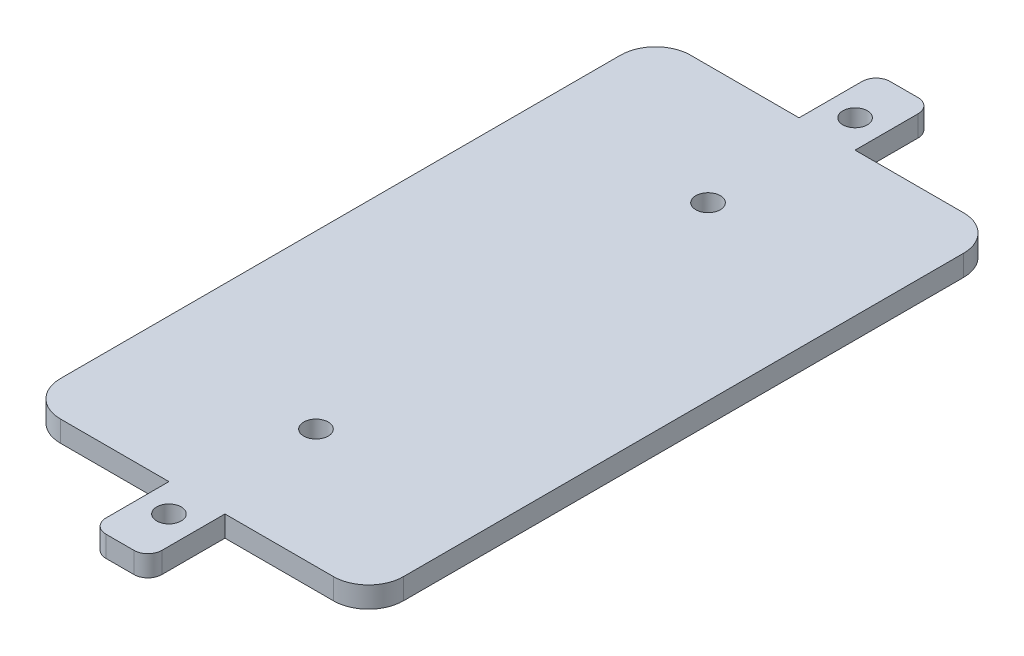
ISO-10303-21;
HEADER;
FILE_DESCRIPTION(('STEP AP214'),'2;1');
FILE_NAME('part.step','',(''),(''),'','','');
FILE_SCHEMA(('AUTOMOTIVE_DESIGN { 1 0 10303 214 1 1 1 1 }'));
ENDSEC;
DATA;
#1=APPLICATION_CONTEXT('core data for automotive mechanical design processes');
#2=APPLICATION_PROTOCOL_DEFINITION('international standard','automotive_design',2000,#1);
#3=PRODUCT_CONTEXT('',#1,'mechanical');
#4=PRODUCT('Part','Part','',(#3));
#5=PRODUCT_RELATED_PRODUCT_CATEGORY('part','',(#4));
#6=PRODUCT_DEFINITION_FORMATION('','',#4);
#7=PRODUCT_DEFINITION_CONTEXT('part definition',#1,'design');
#8=PRODUCT_DEFINITION('design','',#6,#7);
#9=PRODUCT_DEFINITION_SHAPE('','',#8);
#10=(LENGTH_UNIT() NAMED_UNIT(*) SI_UNIT(.MILLI.,.METRE.));
#11=(NAMED_UNIT(*) PLANE_ANGLE_UNIT() SI_UNIT($,.RADIAN.));
#12=(NAMED_UNIT(*) SI_UNIT($,.STERADIAN.) SOLID_ANGLE_UNIT());
#13=UNCERTAINTY_MEASURE_WITH_UNIT(LENGTH_MEASURE(1.E-05),#10,'distance_accuracy_value','');
#14=(GEOMETRIC_REPRESENTATION_CONTEXT(3) GLOBAL_UNCERTAINTY_ASSIGNED_CONTEXT((#13)) GLOBAL_UNIT_ASSIGNED_CONTEXT((#10,
#11,#12)) REPRESENTATION_CONTEXT('',''));
#15=CARTESIAN_POINT('',(0.,0.,0.));
#16=DIRECTION('',(0.,0.,1.));
#17=DIRECTION('',(1.,0.,0.));
#18=AXIS2_PLACEMENT_3D('',#15,#16,#17);
#19=CARTESIAN_POINT('',(0.,3.,45.));
#20=DIRECTION('',(0.,0.,-1.));
#21=DIRECTION('',(-1.,0.,0.));
#22=AXIS2_PLACEMENT_3D('',#19,#20,#21);
#23=PLANE('',#22);
#24=DIRECTION('',(1.,0.,0.));
#25=VECTOR('',#24,1.);
#26=CARTESIAN_POINT('',(0.,3.,45.));
#27=LINE('',#26,#25);
#28=CARTESIAN_POINT('',(-19.5,3.,45.));
#29=VERTEX_POINT('',#28);
#30=CARTESIAN_POINT('',(-4.,3.,45.));
#31=VERTEX_POINT('',#30);
#32=EDGE_CURVE('E175',#29,#31,#27,.T.);
#33=ORIENTED_EDGE('',*,*,#32,.F.);
#34=DIRECTION('',(0.,-1.,0.));
#35=VECTOR('',#34,1.);
#36=CARTESIAN_POINT('',(-19.5,0.,45.));
#37=LINE('',#36,#35);
#38=CARTESIAN_POINT('',(-19.5,0.,45.));
#39=VERTEX_POINT('',#38);
#40=EDGE_CURVE('E245',#29,#39,#37,.T.);
#41=ORIENTED_EDGE('',*,*,#40,.T.);
#42=DIRECTION('',(1.,0.,0.));
#43=VECTOR('',#42,1.);
#44=CARTESIAN_POINT('',(0.,0.,45.));
#45=LINE('',#44,#43);
#46=CARTESIAN_POINT('',(-4.,0.,45.));
#47=VERTEX_POINT('',#46);
#48=EDGE_CURVE('E201',#39,#47,#45,.T.);
#49=ORIENTED_EDGE('',*,*,#48,.T.);
#50=DIRECTION('',(0.,-1.,0.));
#51=VECTOR('',#50,1.);
#52=CARTESIAN_POINT('',(-4.,3.,45.));
#53=LINE('',#52,#51);
#54=EDGE_CURVE('E195',#31,#47,#53,.T.);
#55=ORIENTED_EDGE('',*,*,#54,.F.);
#56=EDGE_LOOP('',(#33,#41,#49,#55));
#57=FACE_BOUND('',#56,.T.);
#58=ADVANCED_FACE('F37',(#57),#23,.F.);
#59=CARTESIAN_POINT('',(-4.00000000000001,3.,0.));
#60=DIRECTION('',(1.,0.,0.));
#61=DIRECTION('',(0.,0.,-1.));
#62=AXIS2_PLACEMENT_3D('',#59,#60,#61);
#63=PLANE('',#62);
#64=DIRECTION('',(0.,0.,1.));
#65=VECTOR('',#64,1.);
#66=CARTESIAN_POINT('',(-4.00000000000001,0.,0.));
#67=LINE('',#66,#65);
#68=CARTESIAN_POINT('',(-4.,0.,54.));
#69=VERTEX_POINT('',#68);
#70=EDGE_CURVE('E347',#47,#69,#67,.T.);
#71=ORIENTED_EDGE('',*,*,#70,.T.);
#72=DIRECTION('',(0.,-1.,0.));
#73=VECTOR('',#72,1.);
#74=CARTESIAN_POINT('',(-4.,3.,54.));
#75=LINE('',#74,#73);
#76=CARTESIAN_POINT('',(-4.,3.,54.));
#77=VERTEX_POINT('',#76);
#78=EDGE_CURVE('E197',#69,#77,#75,.F.);
#79=ORIENTED_EDGE('',*,*,#78,.T.);
#80=DIRECTION('',(0.,0.,1.));
#81=VECTOR('',#80,1.);
#82=CARTESIAN_POINT('',(-4.00000000000001,3.,0.));
#83=LINE('',#82,#81);
#84=EDGE_CURVE('E180',#31,#77,#83,.T.);
#85=ORIENTED_EDGE('',*,*,#84,.F.);
#86=ORIENTED_EDGE('',*,*,#54,.T.);
#87=EDGE_LOOP('',(#71,#79,#85,#86));
#88=FACE_BOUND('',#87,.T.);
#89=ADVANCED_FACE('F194',(#88),#63,.F.);
#90=CARTESIAN_POINT('',(0.,3.,56.));
#91=DIRECTION('',(0.,0.,-1.));
#92=DIRECTION('',(-1.,0.,0.));
#93=AXIS2_PLACEMENT_3D('',#90,#91,#92);
#94=PLANE('',#93);
#95=DIRECTION('',(1.,0.,0.));
#96=VECTOR('',#95,1.);
#97=CARTESIAN_POINT('',(0.,0.,56.));
#98=LINE('',#97,#96);
#99=CARTESIAN_POINT('',(-2.,0.,56.));
#100=VERTEX_POINT('',#99);
#101=CARTESIAN_POINT('',(2.,0.,56.));
#102=VERTEX_POINT('',#101);
#103=EDGE_CURVE('E350',#100,#102,#98,.T.);
#104=ORIENTED_EDGE('',*,*,#103,.T.);
#105=DIRECTION('',(0.,-1.,0.));
#106=VECTOR('',#105,1.);
#107=CARTESIAN_POINT('',(2.,3.,56.));
#108=LINE('',#107,#106);
#109=CARTESIAN_POINT('',(2.,3.,56.));
#110=VERTEX_POINT('',#109);
#111=EDGE_CURVE('E242',#102,#110,#108,.F.);
#112=ORIENTED_EDGE('',*,*,#111,.T.);
#113=DIRECTION('',(1.,0.,0.));
#114=VECTOR('',#113,1.);
#115=CARTESIAN_POINT('',(0.,3.,56.));
#116=LINE('',#115,#114);
#117=CARTESIAN_POINT('',(-2.,3.,56.));
#118=VERTEX_POINT('',#117);
#119=EDGE_CURVE('E198',#118,#110,#116,.T.);
#120=ORIENTED_EDGE('',*,*,#119,.F.);
#121=DIRECTION('',(0.,-1.,0.));
#122=VECTOR('',#121,1.);
#123=CARTESIAN_POINT('',(-2.,3.,56.));
#124=LINE('',#123,#122);
#125=EDGE_CURVE('E239',#118,#100,#124,.T.);
#126=ORIENTED_EDGE('',*,*,#125,.T.);
#127=EDGE_LOOP('',(#104,#112,#120,#126));
#128=FACE_BOUND('',#127,.T.);
#129=ADVANCED_FACE('F384',(#128),#94,.F.);
#130=CARTESIAN_POINT('',(4.,3.,0.));
#131=DIRECTION('',(-1.,0.,0.));
#132=DIRECTION('',(0.,0.,1.));
#133=AXIS2_PLACEMENT_3D('',#130,#131,#132);
#134=PLANE('',#133);
#135=DIRECTION('',(0.,0.,-1.));
#136=VECTOR('',#135,1.);
#137=CARTESIAN_POINT('',(4.,3.,0.));
#138=LINE('',#137,#136);
#139=CARTESIAN_POINT('',(4.,3.,54.));
#140=VERTEX_POINT('',#139);
#141=CARTESIAN_POINT('',(4.,3.,45.));
#142=VERTEX_POINT('',#141);
#143=EDGE_CURVE('E429',#140,#142,#138,.T.);
#144=ORIENTED_EDGE('',*,*,#143,.F.);
#145=DIRECTION('',(0.,-1.,0.));
#146=VECTOR('',#145,1.);
#147=CARTESIAN_POINT('',(4.,3.,54.));
#148=LINE('',#147,#146);
#149=CARTESIAN_POINT('',(4.,0.,54.));
#150=VERTEX_POINT('',#149);
#151=EDGE_CURVE('E236',#140,#150,#148,.T.);
#152=ORIENTED_EDGE('',*,*,#151,.T.);
#153=DIRECTION('',(0.,0.,-1.));
#154=VECTOR('',#153,1.);
#155=CARTESIAN_POINT('',(4.,0.,0.));
#156=LINE('',#155,#154);
#157=CARTESIAN_POINT('',(4.,0.,45.));
#158=VERTEX_POINT('',#157);
#159=EDGE_CURVE('E353',#150,#158,#156,.T.);
#160=ORIENTED_EDGE('',*,*,#159,.T.);
#161=DIRECTION('',(0.,-1.,0.));
#162=VECTOR('',#161,1.);
#163=CARTESIAN_POINT('',(4.,3.,45.));
#164=LINE('',#163,#162);
#165=EDGE_CURVE('E204',#142,#158,#164,.T.);
#166=ORIENTED_EDGE('',*,*,#165,.F.);
#167=EDGE_LOOP('',(#144,#152,#160,#166));
#168=FACE_BOUND('',#167,.T.);
#169=ADVANCED_FACE('F389',(#168),#134,.F.);
#170=CARTESIAN_POINT('',(19.5,0.,45.));
#171=VERTEX_POINT('',#170);
#172=EDGE_CURVE('E293',#158,#171,#45,.T.);
#173=ORIENTED_EDGE('',*,*,#172,.T.);
#174=DIRECTION('',(0.,-1.,0.));
#175=VECTOR('',#174,1.);
#176=CARTESIAN_POINT('',(19.5,3.,45.));
#177=LINE('',#176,#175);
#178=CARTESIAN_POINT('',(19.5,3.,45.));
#179=VERTEX_POINT('',#178);
#180=EDGE_CURVE('E270',#171,#179,#177,.F.);
#181=ORIENTED_EDGE('',*,*,#180,.T.);
#182=EDGE_CURVE('E190',#142,#179,#27,.T.);
#183=ORIENTED_EDGE('',*,*,#182,.F.);
#184=ORIENTED_EDGE('',*,*,#165,.T.);
#185=EDGE_LOOP('',(#173,#181,#183,#184));
#186=FACE_BOUND('',#185,.T.);
#187=ADVANCED_FACE('F361',(#186),#23,.F.);
#188=CARTESIAN_POINT('',(24.5,3.,0.));
#189=DIRECTION('',(-1.,0.,0.));
#190=DIRECTION('',(0.,0.,1.));
#191=AXIS2_PLACEMENT_3D('',#188,#189,#190);
#192=PLANE('',#191);
#193=DIRECTION('',(0.,0.,-1.));
#194=VECTOR('',#193,1.);
#195=CARTESIAN_POINT('',(24.5,3.,0.));
#196=LINE('',#195,#194);
#197=CARTESIAN_POINT('',(24.5,3.,40.));
#198=VERTEX_POINT('',#197);
#199=CARTESIAN_POINT('',(24.5,3.,-40.));
#200=VERTEX_POINT('',#199);
#201=EDGE_CURVE('E320',#198,#200,#196,.T.);
#202=ORIENTED_EDGE('',*,*,#201,.F.);
#203=DIRECTION('',(0.,-1.,0.));
#204=VECTOR('',#203,1.);
#205=CARTESIAN_POINT('',(24.5,3.,40.));
#206=LINE('',#205,#204);
#207=CARTESIAN_POINT('',(24.5,0.,40.));
#208=VERTEX_POINT('',#207);
#209=EDGE_CURVE('E267',#198,#208,#206,.T.);
#210=ORIENTED_EDGE('',*,*,#209,.T.);
#211=DIRECTION('',(0.,0.,-1.));
#212=VECTOR('',#211,1.);
#213=CARTESIAN_POINT('',(24.5,0.,0.));
#214=LINE('',#213,#212);
#215=CARTESIAN_POINT('',(24.5,0.,-40.));
#216=VERTEX_POINT('',#215);
#217=EDGE_CURVE('E288',#208,#216,#214,.T.);
#218=ORIENTED_EDGE('',*,*,#217,.T.);
#219=DIRECTION('',(0.,-1.,0.));
#220=VECTOR('',#219,1.);
#221=CARTESIAN_POINT('',(24.5,3.,-40.));
#222=LINE('',#221,#220);
#223=EDGE_CURVE('E60',#216,#200,#222,.F.);
#224=ORIENTED_EDGE('',*,*,#223,.T.);
#225=EDGE_LOOP('',(#202,#210,#218,#224));
#226=FACE_BOUND('',#225,.T.);
#227=ADVANCED_FACE('F368',(#226),#192,.F.);
#228=CARTESIAN_POINT('',(0.,3.,-45.));
#229=DIRECTION('',(0.,0.,-1.));
#230=DIRECTION('',(-1.,0.,0.));
#231=AXIS2_PLACEMENT_3D('',#228,#229,#230);
#232=PLANE('',#231);
#233=DIRECTION('',(1.,0.,0.));
#234=VECTOR('',#233,1.);
#235=CARTESIAN_POINT('',(0.,3.,-45.));
#236=LINE('',#235,#234);
#237=CARTESIAN_POINT('',(3.99999999999994,3.,-45.));
#238=VERTEX_POINT('',#237);
#239=CARTESIAN_POINT('',(19.5,3.,-45.));
#240=VERTEX_POINT('',#239);
#241=EDGE_CURVE('E279',#238,#240,#236,.T.);
#242=ORIENTED_EDGE('',*,*,#241,.T.);
#243=DIRECTION('',(0.,-1.,0.));
#244=VECTOR('',#243,1.);
#245=CARTESIAN_POINT('',(19.5,0.,-45.));
#246=LINE('',#245,#244);
#247=CARTESIAN_POINT('',(19.5,0.,-45.));
#248=VERTEX_POINT('',#247);
#249=EDGE_CURVE('E45',#240,#248,#246,.T.);
#250=ORIENTED_EDGE('',*,*,#249,.T.);
#251=DIRECTION('',(1.,0.,0.));
#252=VECTOR('',#251,1.);
#253=CARTESIAN_POINT('',(0.,0.,-45.));
#254=LINE('',#253,#252);
#255=CARTESIAN_POINT('',(3.99999999999994,0.,-45.));
#256=VERTEX_POINT('',#255);
#257=EDGE_CURVE('E278',#256,#248,#254,.T.);
#258=ORIENTED_EDGE('',*,*,#257,.F.);
#259=DIRECTION('',(0.,-1.,0.));
#260=VECTOR('',#259,1.);
#261=CARTESIAN_POINT('',(3.99999999999994,3.,-45.));
#262=LINE('',#261,#260);
#263=EDGE_CURVE('E209',#238,#256,#262,.T.);
#264=ORIENTED_EDGE('',*,*,#263,.F.);
#265=EDGE_LOOP('',(#242,#250,#258,#264));
#266=FACE_BOUND('',#265,.T.);
#267=ADVANCED_FACE('F276',(#266),#232,.T.);
#268=CARTESIAN_POINT('',(4.00000000000001,3.,0.));
#269=DIRECTION('',(1.,0.,0.));
#270=DIRECTION('',(0.,0.,-1.));
#271=AXIS2_PLACEMENT_3D('',#268,#269,#270);
#272=PLANE('',#271);
#273=DIRECTION('',(0.,0.,1.));
#274=VECTOR('',#273,1.);
#275=CARTESIAN_POINT('',(4.00000000000001,0.,0.));
#276=LINE('',#275,#274);
#277=CARTESIAN_POINT('',(3.99999999999994,0.,-54.));
#278=VERTEX_POINT('',#277);
#279=EDGE_CURVE('E286',#278,#256,#276,.T.);
#280=ORIENTED_EDGE('',*,*,#279,.F.);
#281=DIRECTION('',(0.,-1.,0.));
#282=VECTOR('',#281,1.);
#283=CARTESIAN_POINT('',(3.99999999999994,3.,-54.));
#284=LINE('',#283,#282);
#285=CARTESIAN_POINT('',(3.99999999999994,3.,-54.));
#286=VERTEX_POINT('',#285);
#287=EDGE_CURVE('E223',#278,#286,#284,.F.);
#288=ORIENTED_EDGE('',*,*,#287,.T.);
#289=DIRECTION('',(0.,0.,1.));
#290=VECTOR('',#289,1.);
#291=CARTESIAN_POINT('',(4.00000000000001,3.,0.));
#292=LINE('',#291,#290);
#293=EDGE_CURVE('E318',#286,#238,#292,.T.);
#294=ORIENTED_EDGE('',*,*,#293,.T.);
#295=ORIENTED_EDGE('',*,*,#263,.T.);
#296=EDGE_LOOP('',(#280,#288,#294,#295));
#297=FACE_BOUND('',#296,.T.);
#298=ADVANCED_FACE('F315',(#297),#272,.T.);
#299=CARTESIAN_POINT('',(0.,3.,-56.));
#300=DIRECTION('',(0.,0.,-1.));
#301=DIRECTION('',(-1.,0.,0.));
#302=AXIS2_PLACEMENT_3D('',#299,#300,#301);
#303=PLANE('',#302);
#304=DIRECTION('',(1.,0.,0.));
#305=VECTOR('',#304,1.);
#306=CARTESIAN_POINT('',(0.,3.,-56.));
#307=LINE('',#306,#305);
#308=CARTESIAN_POINT('',(-2.00000000000006,3.,-56.));
#309=VERTEX_POINT('',#308);
#310=CARTESIAN_POINT('',(1.99999999999994,3.,-56.));
#311=VERTEX_POINT('',#310);
#312=EDGE_CURVE('E323',#309,#311,#307,.T.);
#313=ORIENTED_EDGE('',*,*,#312,.T.);
#314=DIRECTION('',(0.,-1.,0.));
#315=VECTOR('',#314,1.);
#316=CARTESIAN_POINT('',(1.99999999999994,3.,-56.));
#317=LINE('',#316,#315);
#318=CARTESIAN_POINT('',(1.99999999999994,0.,-56.));
#319=VERTEX_POINT('',#318);
#320=EDGE_CURVE('E206',#311,#319,#317,.T.);
#321=ORIENTED_EDGE('',*,*,#320,.T.);
#322=DIRECTION('',(1.,0.,0.));
#323=VECTOR('',#322,1.);
#324=CARTESIAN_POINT('',(0.,0.,-56.));
#325=LINE('',#324,#323);
#326=CARTESIAN_POINT('',(-2.00000000000006,0.,-56.));
#327=VERTEX_POINT('',#326);
#328=EDGE_CURVE('E291',#327,#319,#325,.T.);
#329=ORIENTED_EDGE('',*,*,#328,.F.);
#330=DIRECTION('',(0.,-1.,0.));
#331=VECTOR('',#330,1.);
#332=CARTESIAN_POINT('',(-2.00000000000006,3.,-56.));
#333=LINE('',#332,#331);
#334=EDGE_CURVE('E203',#327,#309,#333,.F.);
#335=ORIENTED_EDGE('',*,*,#334,.T.);
#336=EDGE_LOOP('',(#313,#321,#329,#335));
#337=FACE_BOUND('',#336,.T.);
#338=ADVANCED_FACE('F482',(#337),#303,.T.);
#339=CARTESIAN_POINT('',(-4.,3.,0.));
#340=DIRECTION('',(-1.,0.,0.));
#341=DIRECTION('',(0.,0.,1.));
#342=AXIS2_PLACEMENT_3D('',#339,#340,#341);
#343=PLANE('',#342);
#344=DIRECTION('',(0.,0.,-1.));
#345=VECTOR('',#344,1.);
#346=CARTESIAN_POINT('',(-4.,3.,0.));
#347=LINE('',#346,#345);
#348=CARTESIAN_POINT('',(-4.00000000000006,3.,-45.));
#349=VERTEX_POINT('',#348);
#350=CARTESIAN_POINT('',(-4.00000000000006,3.,-54.));
#351=VERTEX_POINT('',#350);
#352=EDGE_CURVE('E327',#349,#351,#347,.T.);
#353=ORIENTED_EDGE('',*,*,#352,.T.);
#354=DIRECTION('',(0.,-1.,0.));
#355=VECTOR('',#354,1.);
#356=CARTESIAN_POINT('',(-4.00000000000006,3.,-54.));
#357=LINE('',#356,#355);
#358=CARTESIAN_POINT('',(-4.00000000000006,0.,-54.));
#359=VERTEX_POINT('',#358);
#360=EDGE_CURVE('E233',#351,#359,#357,.T.);
#361=ORIENTED_EDGE('',*,*,#360,.T.);
#362=DIRECTION('',(0.,0.,-1.));
#363=VECTOR('',#362,1.);
#364=CARTESIAN_POINT('',(-4.,0.,0.));
#365=LINE('',#364,#363);
#366=CARTESIAN_POINT('',(-4.00000000000006,0.,-45.));
#367=VERTEX_POINT('',#366);
#368=EDGE_CURVE('E296',#367,#359,#365,.T.);
#369=ORIENTED_EDGE('',*,*,#368,.F.);
#370=DIRECTION('',(0.,-1.,0.));
#371=VECTOR('',#370,1.);
#372=CARTESIAN_POINT('',(-4.00000000000006,3.,-45.));
#373=LINE('',#372,#371);
#374=EDGE_CURVE('E312',#349,#367,#373,.T.);
#375=ORIENTED_EDGE('',*,*,#374,.F.);
#376=EDGE_LOOP('',(#353,#361,#369,#375));
#377=FACE_BOUND('',#376,.T.);
#378=ADVANCED_FACE('F479',(#377),#343,.T.);
#379=CARTESIAN_POINT('',(-19.5,0.,-45.));
#380=VERTEX_POINT('',#379);
#381=EDGE_CURVE('E290',#380,#367,#254,.T.);
#382=ORIENTED_EDGE('',*,*,#381,.F.);
#383=DIRECTION('',(0.,-1.,0.));
#384=VECTOR('',#383,1.);
#385=CARTESIAN_POINT('',(-19.5,3.,-45.));
#386=LINE('',#385,#384);
#387=CARTESIAN_POINT('',(-19.5,3.,-45.));
#388=VERTEX_POINT('',#387);
#389=EDGE_CURVE('E11',#380,#388,#386,.F.);
#390=ORIENTED_EDGE('',*,*,#389,.T.);
#391=EDGE_CURVE('E322',#388,#349,#236,.T.);
#392=ORIENTED_EDGE('',*,*,#391,.T.);
#393=ORIENTED_EDGE('',*,*,#374,.T.);
#394=EDGE_LOOP('',(#382,#390,#392,#393));
#395=FACE_BOUND('',#394,.T.);
#396=ADVANCED_FACE('F472',(#395),#232,.T.);
#397=CARTESIAN_POINT('',(0.,3.,-49.));
#398=DIRECTION('',(0.,-1.,0.));
#399=DIRECTION('',(0.,0.,-1.));
#400=AXIS2_PLACEMENT_3D('',#397,#398,#399);
#401=CYLINDRICAL_SURFACE('',#400,1.75);
#402=CARTESIAN_POINT('',(0.,3.,-49.));
#403=DIRECTION('',(0.,1.,0.));
#404=DIRECTION('',(0.,0.,1.));
#405=AXIS2_PLACEMENT_3D('',#402,#403,#404);
#406=CIRCLE('',#405,1.75);
#407=CARTESIAN_POINT('',(0.,3.,-47.25));
#408=VERTEX_POINT('',#407);
#409=EDGE_CURVE('E332',#408,#408,#406,.F.);
#410=ORIENTED_EDGE('',*,*,#409,.F.);
#411=EDGE_LOOP('',(#410));
#412=FACE_BOUND('',#411,.T.);
#413=CARTESIAN_POINT('',(0.,0.,-49.));
#414=DIRECTION('',(0.,1.,0.));
#415=DIRECTION('',(0.,0.,1.));
#416=AXIS2_PLACEMENT_3D('',#413,#414,#415);
#417=CIRCLE('',#416,1.75);
#418=CARTESIAN_POINT('',(0.,0.,-47.25));
#419=VERTEX_POINT('',#418);
#420=EDGE_CURVE('E301',#419,#419,#417,.F.);
#421=ORIENTED_EDGE('',*,*,#420,.T.);
#422=EDGE_LOOP('',(#421));
#423=FACE_BOUND('',#422,.T.);
#424=ADVANCED_FACE('F469',(#412,#423),#401,.F.);
#425=CARTESIAN_POINT('',(-24.5,3.,0.));
#426=DIRECTION('',(-1.,0.,0.));
#427=DIRECTION('',(0.,0.,1.));
#428=AXIS2_PLACEMENT_3D('',#425,#426,#427);
#429=PLANE('',#428);
#430=DIRECTION('',(0.,0.,-1.));
#431=VECTOR('',#430,1.);
#432=CARTESIAN_POINT('',(-24.5,0.,0.));
#433=LINE('',#432,#431);
#434=CARTESIAN_POINT('',(-24.5,0.,40.));
#435=VERTEX_POINT('',#434);
#436=CARTESIAN_POINT('',(-24.5,0.,-40.));
#437=VERTEX_POINT('',#436);
#438=EDGE_CURVE('E295',#435,#437,#433,.T.);
#439=ORIENTED_EDGE('',*,*,#438,.F.);
#440=DIRECTION('',(0.,-1.,0.));
#441=VECTOR('',#440,1.);
#442=CARTESIAN_POINT('',(-24.5,3.,40.));
#443=LINE('',#442,#441);
#444=CARTESIAN_POINT('',(-24.5,3.,40.));
#445=VERTEX_POINT('',#444);
#446=EDGE_CURVE('E258',#435,#445,#443,.F.);
#447=ORIENTED_EDGE('',*,*,#446,.T.);
#448=DIRECTION('',(0.,0.,-1.));
#449=VECTOR('',#448,1.);
#450=CARTESIAN_POINT('',(-24.5,3.,0.));
#451=LINE('',#450,#449);
#452=CARTESIAN_POINT('',(-24.5,3.,-40.));
#453=VERTEX_POINT('',#452);
#454=EDGE_CURVE('E326',#445,#453,#451,.T.);
#455=ORIENTED_EDGE('',*,*,#454,.T.);
#456=DIRECTION('',(0.,-1.,0.));
#457=VECTOR('',#456,1.);
#458=CARTESIAN_POINT('',(-24.5,3.,-40.));
#459=LINE('',#458,#457);
#460=EDGE_CURVE('E255',#453,#437,#459,.T.);
#461=ORIENTED_EDGE('',*,*,#460,.T.);
#462=EDGE_LOOP('',(#439,#447,#455,#461));
#463=FACE_BOUND('',#462,.T.);
#464=ADVANCED_FACE('F467',(#463),#429,.T.);
#465=CARTESIAN_POINT('',(0.,3.,49.));
#466=DIRECTION('',(0.,-1.,0.));
#467=DIRECTION('',(0.,0.,-1.));
#468=AXIS2_PLACEMENT_3D('',#465,#466,#467);
#469=CYLINDRICAL_SURFACE('',#468,1.75);
#470=CARTESIAN_POINT('',(0.,3.,49.));
#471=DIRECTION('',(0.,1.,0.));
#472=DIRECTION('',(0.,0.,1.));
#473=AXIS2_PLACEMENT_3D('',#470,#471,#472);
#474=CIRCLE('',#473,1.75);
#475=CARTESIAN_POINT('',(0.,3.,50.75));
#476=VERTEX_POINT('',#475);
#477=EDGE_CURVE('E313',#476,#476,#474,.T.);
#478=ORIENTED_EDGE('',*,*,#477,.T.);
#479=EDGE_LOOP('',(#478));
#480=FACE_BOUND('',#479,.T.);
#481=CARTESIAN_POINT('',(0.,0.,49.));
#482=DIRECTION('',(0.,1.,0.));
#483=DIRECTION('',(0.,0.,1.));
#484=AXIS2_PLACEMENT_3D('',#481,#482,#483);
#485=CIRCLE('',#484,1.75);
#486=CARTESIAN_POINT('',(0.,0.,50.75));
#487=VERTEX_POINT('',#486);
#488=EDGE_CURVE('E188',#487,#487,#485,.T.);
#489=ORIENTED_EDGE('',*,*,#488,.F.);
#490=EDGE_LOOP('',(#489));
#491=FACE_BOUND('',#490,.T.);
#492=ADVANCED_FACE('F462',(#480,#491),#469,.F.);
#493=CARTESIAN_POINT('',(0.,3.,0.));
#494=DIRECTION('',(0.,1.,0.));
#495=DIRECTION('',(0.,0.,1.));
#496=AXIS2_PLACEMENT_3D('',#493,#494,#495);
#497=PLANE('',#496);
#498=CARTESIAN_POINT('',(0.,3.,-28.));
#499=DIRECTION('',(0.,1.,0.));
#500=DIRECTION('',(0.,0.,1.));
#501=AXIS2_PLACEMENT_3D('',#498,#499,#500);
#502=CIRCLE('',#501,1.75);
#503=CARTESIAN_POINT('',(0.,3.,-26.25));
#504=VERTEX_POINT('',#503);
#505=EDGE_CURVE('E348',#504,#504,#502,.T.);
#506=ORIENTED_EDGE('',*,*,#505,.F.);
#507=EDGE_LOOP('',(#506));
#508=FACE_BOUND('',#507,.T.);
#509=CARTESIAN_POINT('',(0.,3.,28.));
#510=DIRECTION('',(0.,1.,0.));
#511=DIRECTION('',(0.,0.,1.));
#512=AXIS2_PLACEMENT_3D('',#509,#510,#511);
#513=CIRCLE('',#512,1.75);
#514=CARTESIAN_POINT('',(0.,3.,29.75));
#515=VERTEX_POINT('',#514);
#516=EDGE_CURVE('E435',#515,#515,#513,.T.);
#517=ORIENTED_EDGE('',*,*,#516,.F.);
#518=EDGE_LOOP('',(#517));
#519=FACE_BOUND('',#518,.T.);
#520=ORIENTED_EDGE('',*,*,#454,.F.);
#521=CARTESIAN_POINT('',(-19.5,3.,40.));
#522=DIRECTION('',(0.,1.,0.));
#523=DIRECTION('',(0.,0.,1.));
#524=AXIS2_PLACEMENT_3D('',#521,#522,#523);
#525=CIRCLE('',#524,5.);
#526=EDGE_CURVE('E183',#445,#29,#525,.T.);
#527=ORIENTED_EDGE('',*,*,#526,.T.);
#528=ORIENTED_EDGE('',*,*,#32,.T.);
#529=ORIENTED_EDGE('',*,*,#84,.T.);
#530=CARTESIAN_POINT('',(-2.,3.,54.));
#531=DIRECTION('',(0.,1.,0.));
#532=DIRECTION('',(0.,0.,1.));
#533=AXIS2_PLACEMENT_3D('',#530,#531,#532);
#534=CIRCLE('',#533,2.);
#535=EDGE_CURVE('E225',#77,#118,#534,.T.);
#536=ORIENTED_EDGE('',*,*,#535,.T.);
#537=ORIENTED_EDGE('',*,*,#119,.T.);
#538=CARTESIAN_POINT('',(2.,3.,54.));
#539=DIRECTION('',(0.,1.,0.));
#540=DIRECTION('',(0.,0.,1.));
#541=AXIS2_PLACEMENT_3D('',#538,#539,#540);
#542=CIRCLE('',#541,2.);
#543=EDGE_CURVE('E227',#110,#140,#542,.T.);
#544=ORIENTED_EDGE('',*,*,#543,.T.);
#545=ORIENTED_EDGE('',*,*,#143,.T.);
#546=ORIENTED_EDGE('',*,*,#182,.T.);
#547=CARTESIAN_POINT('',(19.5,3.,40.));
#548=DIRECTION('',(0.,1.,0.));
#549=DIRECTION('',(0.,0.,1.));
#550=AXIS2_PLACEMENT_3D('',#547,#548,#549);
#551=CIRCLE('',#550,5.);
#552=EDGE_CURVE('E263',#179,#198,#551,.T.);
#553=ORIENTED_EDGE('',*,*,#552,.T.);
#554=ORIENTED_EDGE('',*,*,#201,.T.);
#555=CARTESIAN_POINT('',(19.5,3.,-40.));
#556=DIRECTION('',(0.,1.,0.));
#557=DIRECTION('',(0.,0.,1.));
#558=AXIS2_PLACEMENT_3D('',#555,#556,#557);
#559=CIRCLE('',#558,5.);
#560=EDGE_CURVE('E52',#200,#240,#559,.T.);
#561=ORIENTED_EDGE('',*,*,#560,.T.);
#562=ORIENTED_EDGE('',*,*,#241,.F.);
#563=ORIENTED_EDGE('',*,*,#293,.F.);
#564=CARTESIAN_POINT('',(1.99999999999994,3.,-54.));
#565=DIRECTION('',(0.,1.,0.));
#566=DIRECTION('',(0.,0.,1.));
#567=AXIS2_PLACEMENT_3D('',#564,#565,#566);
#568=CIRCLE('',#567,2.);
#569=EDGE_CURVE('E231',#286,#311,#568,.T.);
#570=ORIENTED_EDGE('',*,*,#569,.T.);
#571=ORIENTED_EDGE('',*,*,#312,.F.);
#572=CARTESIAN_POINT('',(-2.00000000000006,3.,-54.));
#573=DIRECTION('',(0.,1.,0.));
#574=DIRECTION('',(0.,0.,1.));
#575=AXIS2_PLACEMENT_3D('',#572,#573,#574);
#576=CIRCLE('',#575,2.);
#577=EDGE_CURVE('E229',#309,#351,#576,.T.);
#578=ORIENTED_EDGE('',*,*,#577,.T.);
#579=ORIENTED_EDGE('',*,*,#352,.F.);
#580=ORIENTED_EDGE('',*,*,#391,.F.);
#581=CARTESIAN_POINT('',(-19.5,3.,-40.));
#582=DIRECTION('',(0.,1.,0.));
#583=DIRECTION('',(0.,0.,1.));
#584=AXIS2_PLACEMENT_3D('',#581,#582,#583);
#585=CIRCLE('',#584,5.);
#586=EDGE_CURVE('E260',#388,#453,#585,.T.);
#587=ORIENTED_EDGE('',*,*,#586,.T.);
#588=EDGE_LOOP('',(#520,#527,#528,#529,#536,#537,#544,#545,#546,#553,#554,#561,#562,#563,#570,
#571,#578,#579,#580,#587));
#589=FACE_BOUND('',#588,.T.);
#590=ORIENTED_EDGE('',*,*,#409,.T.);
#591=EDGE_LOOP('',(#590));
#592=FACE_BOUND('',#591,.T.);
#593=ORIENTED_EDGE('',*,*,#477,.F.);
#594=EDGE_LOOP('',(#593));
#595=FACE_BOUND('',#594,.T.);
#596=ADVANCED_FACE('F178',(#508,#519,#589,#592,#595),#497,.T.);
#597=CARTESIAN_POINT('',(0.,0.,0.));
#598=DIRECTION('',(0.,1.,0.));
#599=DIRECTION('',(0.,0.,1.));
#600=AXIS2_PLACEMENT_3D('',#597,#598,#599);
#601=PLANE('',#600);
#602=CARTESIAN_POINT('',(0.,0.,-28.));
#603=DIRECTION('',(0.,-1.,0.));
#604=DIRECTION('',(0.,0.,-1.));
#605=AXIS2_PLACEMENT_3D('',#602,#603,#604);
#606=CIRCLE('',#605,1.75);
#607=CARTESIAN_POINT('',(0.,0.,-29.75));
#608=VERTEX_POINT('',#607);
#609=EDGE_CURVE('E438',#608,#608,#606,.T.);
#610=ORIENTED_EDGE('',*,*,#609,.F.);
#611=EDGE_LOOP('',(#610));
#612=FACE_BOUND('',#611,.T.);
#613=CARTESIAN_POINT('',(0.,0.,28.));
#614=DIRECTION('',(0.,-1.,0.));
#615=DIRECTION('',(0.,0.,-1.));
#616=AXIS2_PLACEMENT_3D('',#613,#614,#615);
#617=CIRCLE('',#616,1.75);
#618=CARTESIAN_POINT('',(0.,0.,26.25));
#619=VERTEX_POINT('',#618);
#620=EDGE_CURVE('E439',#619,#619,#617,.T.);
#621=ORIENTED_EDGE('',*,*,#620,.F.);
#622=EDGE_LOOP('',(#621));
#623=FACE_BOUND('',#622,.T.);
#624=ORIENTED_EDGE('',*,*,#48,.F.);
#625=CARTESIAN_POINT('',(-19.5,0.,40.));
#626=DIRECTION('',(0.,1.,0.));
#627=DIRECTION('',(0.,0.,1.));
#628=AXIS2_PLACEMENT_3D('',#625,#626,#627);
#629=CIRCLE('',#628,5.);
#630=EDGE_CURVE('E253',#39,#435,#629,.F.);
#631=ORIENTED_EDGE('',*,*,#630,.T.);
#632=ORIENTED_EDGE('',*,*,#438,.T.);
#633=CARTESIAN_POINT('',(-19.5,0.,-40.));
#634=DIRECTION('',(0.,1.,0.));
#635=DIRECTION('',(0.,0.,1.));
#636=AXIS2_PLACEMENT_3D('',#633,#634,#635);
#637=CIRCLE('',#636,5.);
#638=EDGE_CURVE('E247',#437,#380,#637,.F.);
#639=ORIENTED_EDGE('',*,*,#638,.T.);
#640=ORIENTED_EDGE('',*,*,#381,.T.);
#641=ORIENTED_EDGE('',*,*,#368,.T.);
#642=CARTESIAN_POINT('',(-2.00000000000006,0.,-54.));
#643=DIRECTION('',(0.,1.,0.));
#644=DIRECTION('',(0.,0.,1.));
#645=AXIS2_PLACEMENT_3D('',#642,#643,#644);
#646=CIRCLE('',#645,2.);
#647=EDGE_CURVE('E219',#359,#327,#646,.F.);
#648=ORIENTED_EDGE('',*,*,#647,.T.);
#649=ORIENTED_EDGE('',*,*,#328,.T.);
#650=CARTESIAN_POINT('',(1.99999999999994,0.,-54.));
#651=DIRECTION('',(0.,1.,0.));
#652=DIRECTION('',(0.,0.,1.));
#653=AXIS2_PLACEMENT_3D('',#650,#651,#652);
#654=CIRCLE('',#653,2.);
#655=EDGE_CURVE('E221',#319,#278,#654,.F.);
#656=ORIENTED_EDGE('',*,*,#655,.T.);
#657=ORIENTED_EDGE('',*,*,#279,.T.);
#658=ORIENTED_EDGE('',*,*,#257,.T.);
#659=CARTESIAN_POINT('',(19.5,0.,-40.));
#660=DIRECTION('',(0.,1.,0.));
#661=DIRECTION('',(0.,0.,1.));
#662=AXIS2_PLACEMENT_3D('',#659,#660,#661);
#663=CIRCLE('',#662,5.);
#664=EDGE_CURVE('E249',#248,#216,#663,.F.);
#665=ORIENTED_EDGE('',*,*,#664,.T.);
#666=ORIENTED_EDGE('',*,*,#217,.F.);
#667=CARTESIAN_POINT('',(19.5,0.,40.));
#668=DIRECTION('',(0.,1.,0.));
#669=DIRECTION('',(0.,0.,1.));
#670=AXIS2_PLACEMENT_3D('',#667,#668,#669);
#671=CIRCLE('',#670,5.);
#672=EDGE_CURVE('E251',#208,#171,#671,.F.);
#673=ORIENTED_EDGE('',*,*,#672,.T.);
#674=ORIENTED_EDGE('',*,*,#172,.F.);
#675=ORIENTED_EDGE('',*,*,#159,.F.);
#676=CARTESIAN_POINT('',(2.,0.,54.));
#677=DIRECTION('',(0.,1.,0.));
#678=DIRECTION('',(0.,0.,1.));
#679=AXIS2_PLACEMENT_3D('',#676,#677,#678);
#680=CIRCLE('',#679,2.);
#681=EDGE_CURVE('E217',#150,#102,#680,.F.);
#682=ORIENTED_EDGE('',*,*,#681,.T.);
#683=ORIENTED_EDGE('',*,*,#103,.F.);
#684=CARTESIAN_POINT('',(-2.,0.,54.));
#685=DIRECTION('',(0.,1.,0.));
#686=DIRECTION('',(0.,0.,1.));
#687=AXIS2_PLACEMENT_3D('',#684,#685,#686);
#688=CIRCLE('',#687,2.);
#689=EDGE_CURVE('E215',#100,#69,#688,.F.);
#690=ORIENTED_EDGE('',*,*,#689,.T.);
#691=ORIENTED_EDGE('',*,*,#70,.F.);
#692=EDGE_LOOP('',(#624,#631,#632,#639,#640,#641,#648,#649,#656,#657,#658,#665,#666,#673,#674,
#675,#682,#683,#690,#691));
#693=FACE_BOUND('',#692,.T.);
#694=ORIENTED_EDGE('',*,*,#420,.F.);
#695=EDGE_LOOP('',(#694));
#696=FACE_BOUND('',#695,.T.);
#697=ORIENTED_EDGE('',*,*,#488,.T.);
#698=EDGE_LOOP('',(#697));
#699=FACE_BOUND('',#698,.T.);
#700=ADVANCED_FACE('F282',(#612,#623,#693,#696,#699),#601,.F.);
#701=CARTESIAN_POINT('',(1.99999999999994,3.,-54.));
#702=DIRECTION('',(0.,-1.,0.));
#703=DIRECTION('',(0.,0.,-1.));
#704=AXIS2_PLACEMENT_3D('',#701,#702,#703);
#705=CYLINDRICAL_SURFACE('',#704,2.);
#706=ORIENTED_EDGE('',*,*,#569,.F.);
#707=ORIENTED_EDGE('',*,*,#287,.F.);
#708=ORIENTED_EDGE('',*,*,#655,.F.);
#709=ORIENTED_EDGE('',*,*,#320,.F.);
#710=EDGE_LOOP('',(#706,#707,#708,#709));
#711=FACE_BOUND('',#710,.T.);
#712=ADVANCED_FACE('F401',(#711),#705,.T.);
#713=CARTESIAN_POINT('',(-2.00000000000006,3.,-54.));
#714=DIRECTION('',(0.,-1.,0.));
#715=DIRECTION('',(0.,0.,-1.));
#716=AXIS2_PLACEMENT_3D('',#713,#714,#715);
#717=CYLINDRICAL_SURFACE('',#716,2.);
#718=ORIENTED_EDGE('',*,*,#577,.F.);
#719=ORIENTED_EDGE('',*,*,#334,.F.);
#720=ORIENTED_EDGE('',*,*,#647,.F.);
#721=ORIENTED_EDGE('',*,*,#360,.F.);
#722=EDGE_LOOP('',(#718,#719,#720,#721));
#723=FACE_BOUND('',#722,.T.);
#724=ADVANCED_FACE('F404',(#723),#717,.T.);
#725=CARTESIAN_POINT('',(2.,3.,54.));
#726=DIRECTION('',(0.,-1.,0.));
#727=DIRECTION('',(0.,0.,-1.));
#728=AXIS2_PLACEMENT_3D('',#725,#726,#727);
#729=CYLINDRICAL_SURFACE('',#728,2.);
#730=ORIENTED_EDGE('',*,*,#543,.F.);
#731=ORIENTED_EDGE('',*,*,#111,.F.);
#732=ORIENTED_EDGE('',*,*,#681,.F.);
#733=ORIENTED_EDGE('',*,*,#151,.F.);
#734=EDGE_LOOP('',(#730,#731,#732,#733));
#735=FACE_BOUND('',#734,.T.);
#736=ADVANCED_FACE('F408',(#735),#729,.T.);
#737=CARTESIAN_POINT('',(-2.,3.,54.));
#738=DIRECTION('',(0.,-1.,0.));
#739=DIRECTION('',(0.,0.,-1.));
#740=AXIS2_PLACEMENT_3D('',#737,#738,#739);
#741=CYLINDRICAL_SURFACE('',#740,2.);
#742=ORIENTED_EDGE('',*,*,#535,.F.);
#743=ORIENTED_EDGE('',*,*,#78,.F.);
#744=ORIENTED_EDGE('',*,*,#689,.F.);
#745=ORIENTED_EDGE('',*,*,#125,.F.);
#746=EDGE_LOOP('',(#742,#743,#744,#745));
#747=FACE_BOUND('',#746,.T.);
#748=ADVANCED_FACE('F412',(#747),#741,.T.);
#749=CARTESIAN_POINT('',(-19.5,3.,40.));
#750=DIRECTION('',(0.,1.,0.));
#751=DIRECTION('',(0.,0.,1.));
#752=AXIS2_PLACEMENT_3D('',#749,#750,#751);
#753=CYLINDRICAL_SURFACE('',#752,5.);
#754=ORIENTED_EDGE('',*,*,#526,.F.);
#755=ORIENTED_EDGE('',*,*,#446,.F.);
#756=ORIENTED_EDGE('',*,*,#630,.F.);
#757=ORIENTED_EDGE('',*,*,#40,.F.);
#758=EDGE_LOOP('',(#754,#755,#756,#757));
#759=FACE_BOUND('',#758,.T.);
#760=ADVANCED_FACE('F377',(#759),#753,.T.);
#761=CARTESIAN_POINT('',(19.5,3.,40.));
#762=DIRECTION('',(0.,-1.,0.));
#763=DIRECTION('',(0.,0.,-1.));
#764=AXIS2_PLACEMENT_3D('',#761,#762,#763);
#765=CYLINDRICAL_SURFACE('',#764,5.);
#766=ORIENTED_EDGE('',*,*,#552,.F.);
#767=ORIENTED_EDGE('',*,*,#180,.F.);
#768=ORIENTED_EDGE('',*,*,#672,.F.);
#769=ORIENTED_EDGE('',*,*,#209,.F.);
#770=EDGE_LOOP('',(#766,#767,#768,#769));
#771=FACE_BOUND('',#770,.T.);
#772=ADVANCED_FACE('F366',(#771),#765,.T.);
#773=CARTESIAN_POINT('',(19.5,3.,-40.));
#774=DIRECTION('',(0.,1.,0.));
#775=DIRECTION('',(0.,0.,1.));
#776=AXIS2_PLACEMENT_3D('',#773,#774,#775);
#777=CYLINDRICAL_SURFACE('',#776,5.);
#778=ORIENTED_EDGE('',*,*,#560,.F.);
#779=ORIENTED_EDGE('',*,*,#223,.F.);
#780=ORIENTED_EDGE('',*,*,#664,.F.);
#781=ORIENTED_EDGE('',*,*,#249,.F.);
#782=EDGE_LOOP('',(#778,#779,#780,#781));
#783=FACE_BOUND('',#782,.T.);
#784=ADVANCED_FACE('F369',(#783),#777,.T.);
#785=CARTESIAN_POINT('',(-19.5,3.,-40.));
#786=DIRECTION('',(0.,-1.,0.));
#787=DIRECTION('',(0.,0.,-1.));
#788=AXIS2_PLACEMENT_3D('',#785,#786,#787);
#789=CYLINDRICAL_SURFACE('',#788,5.);
#790=ORIENTED_EDGE('',*,*,#586,.F.);
#791=ORIENTED_EDGE('',*,*,#389,.F.);
#792=ORIENTED_EDGE('',*,*,#638,.F.);
#793=ORIENTED_EDGE('',*,*,#460,.F.);
#794=EDGE_LOOP('',(#790,#791,#792,#793));
#795=FACE_BOUND('',#794,.T.);
#796=ADVANCED_FACE('F39',(#795),#789,.T.);
#797=CARTESIAN_POINT('',(0.,10.,28.));
#798=DIRECTION('',(0.,-1.,0.));
#799=DIRECTION('',(0.,0.,-1.));
#800=AXIS2_PLACEMENT_3D('',#797,#798,#799);
#801=CYLINDRICAL_SURFACE('',#800,1.75);
#802=ORIENTED_EDGE('',*,*,#516,.T.);
#803=EDGE_LOOP('',(#802));
#804=FACE_BOUND('',#803,.T.);
#805=ORIENTED_EDGE('',*,*,#620,.T.);
#806=EDGE_LOOP('',(#805));
#807=FACE_BOUND('',#806,.T.);
#808=ADVANCED_FACE('F375',(#804,#807),#801,.F.);
#809=CARTESIAN_POINT('',(0.,10.,-28.));
#810=DIRECTION('',(0.,-1.,0.));
#811=DIRECTION('',(0.,0.,-1.));
#812=AXIS2_PLACEMENT_3D('',#809,#810,#811);
#813=CYLINDRICAL_SURFACE('',#812,1.75);
#814=ORIENTED_EDGE('',*,*,#505,.T.);
#815=EDGE_LOOP('',(#814));
#816=FACE_BOUND('',#815,.T.);
#817=ORIENTED_EDGE('',*,*,#609,.T.);
#818=EDGE_LOOP('',(#817));
#819=FACE_BOUND('',#818,.T.);
#820=ADVANCED_FACE('F445',(#816,#819),#813,.F.);
#821=CLOSED_SHELL('',(#58,#89,#129,#169,#187,#227,#267,#298,#338,#378,#396,#424,#464,#492,#596,
#700,#712,#724,#736,#748,#760,#772,#784,#796,#808,#820));
#822=MANIFOLD_SOLID_BREP('B2',#821);
#823=ADVANCED_BREP_SHAPE_REPRESENTATION('',(#18,#822),#14);
#824=SHAPE_DEFINITION_REPRESENTATION(#9,#823);
ENDSEC;
END-ISO-10303-21;
